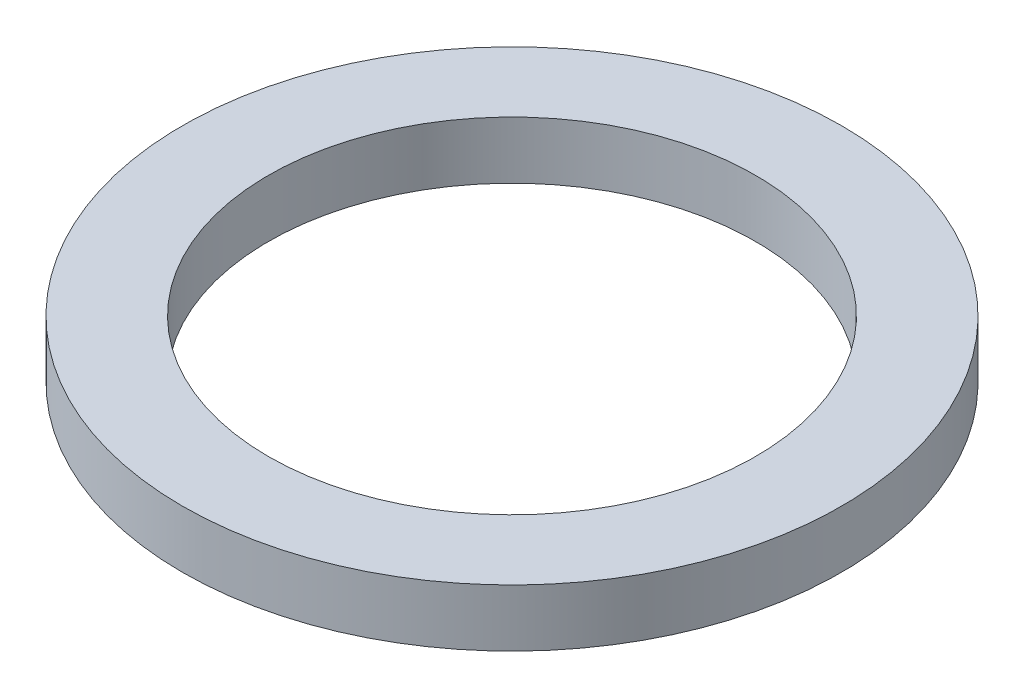
ISO-10303-21;
HEADER;
FILE_DESCRIPTION(('STEP AP214'),'2;1');
FILE_NAME('part.step','',(''),(''),'','','');
FILE_SCHEMA(('AUTOMOTIVE_DESIGN { 1 0 10303 214 1 1 1 1 }'));
ENDSEC;
DATA;
#1=APPLICATION_CONTEXT('core data for automotive mechanical design processes');
#2=APPLICATION_PROTOCOL_DEFINITION('international standard','automotive_design',2000,#1);
#3=PRODUCT_CONTEXT('',#1,'mechanical');
#4=PRODUCT('Part','Part','',(#3));
#5=PRODUCT_RELATED_PRODUCT_CATEGORY('part','',(#4));
#6=PRODUCT_DEFINITION_FORMATION('','',#4);
#7=PRODUCT_DEFINITION_CONTEXT('part definition',#1,'design');
#8=PRODUCT_DEFINITION('design','',#6,#7);
#9=PRODUCT_DEFINITION_SHAPE('','',#8);
#10=(LENGTH_UNIT() NAMED_UNIT(*) SI_UNIT(.MILLI.,.METRE.));
#11=(NAMED_UNIT(*) PLANE_ANGLE_UNIT() SI_UNIT($,.RADIAN.));
#12=(NAMED_UNIT(*) SI_UNIT($,.STERADIAN.) SOLID_ANGLE_UNIT());
#13=UNCERTAINTY_MEASURE_WITH_UNIT(LENGTH_MEASURE(1.E-05),#10,'distance_accuracy_value','');
#14=(GEOMETRIC_REPRESENTATION_CONTEXT(3) GLOBAL_UNCERTAINTY_ASSIGNED_CONTEXT((#13)) GLOBAL_UNIT_ASSIGNED_CONTEXT((#10,
#11,#12)) REPRESENTATION_CONTEXT('',''));
#15=CARTESIAN_POINT('',(0.,0.,0.));
#16=DIRECTION('',(0.,0.,1.));
#17=DIRECTION('',(1.,0.,0.));
#18=AXIS2_PLACEMENT_3D('',#15,#16,#17);
#19=CARTESIAN_POINT('',(0.,10.,0.));
#20=DIRECTION('',(0.,-1.,0.));
#21=DIRECTION('',(0.,0.,-1.));
#22=AXIS2_PLACEMENT_3D('',#19,#20,#21);
#23=CYLINDRICAL_SURFACE('',#22,57.5);
#24=CARTESIAN_POINT('',(0.,10.,0.));
#25=DIRECTION('',(0.,1.,0.));
#26=DIRECTION('',(0.,0.,1.));
#27=AXIS2_PLACEMENT_3D('',#24,#25,#26);
#28=CIRCLE('',#27,57.5);
#29=CARTESIAN_POINT('',(0.,10.,57.5));
#30=VERTEX_POINT('',#29);
#31=EDGE_CURVE('E10',#30,#30,#28,.T.);
#32=ORIENTED_EDGE('',*,*,#31,.F.);
#33=EDGE_LOOP('',(#32));
#34=FACE_BOUND('',#33,.T.);
#35=CARTESIAN_POINT('',(0.,0.,0.));
#36=DIRECTION('',(0.,1.,0.));
#37=DIRECTION('',(0.,0.,1.));
#38=AXIS2_PLACEMENT_3D('',#35,#36,#37);
#39=CIRCLE('',#38,57.5);
#40=CARTESIAN_POINT('',(0.,0.,57.5));
#41=VERTEX_POINT('',#40);
#42=EDGE_CURVE('E37',#41,#41,#39,.T.);
#43=ORIENTED_EDGE('',*,*,#42,.T.);
#44=EDGE_LOOP('',(#43));
#45=FACE_BOUND('',#44,.T.);
#46=ADVANCED_FACE('F40',(#34,#45),#23,.T.);
#47=CARTESIAN_POINT('',(0.,10.,0.));
#48=DIRECTION('',(0.,1.,0.));
#49=DIRECTION('',(0.,0.,1.));
#50=AXIS2_PLACEMENT_3D('',#47,#48,#49);
#51=PLANE('',#50);
#52=CARTESIAN_POINT('',(0.,10.,0.));
#53=DIRECTION('',(0.,1.,0.));
#54=DIRECTION('',(0.,0.,1.));
#55=AXIS2_PLACEMENT_3D('',#52,#53,#54);
#56=CIRCLE('',#55,42.5);
#57=CARTESIAN_POINT('',(0.,10.,42.5));
#58=VERTEX_POINT('',#57);
#59=EDGE_CURVE('E50',#58,#58,#56,.T.);
#60=ORIENTED_EDGE('',*,*,#59,.F.);
#61=EDGE_LOOP('',(#60));
#62=FACE_BOUND('',#61,.T.);
#63=ORIENTED_EDGE('',*,*,#31,.T.);
#64=EDGE_LOOP('',(#63));
#65=FACE_BOUND('',#64,.T.);
#66=ADVANCED_FACE('F59',(#62,#65),#51,.T.);
#67=CARTESIAN_POINT('',(0.,0.,0.));
#68=DIRECTION('',(0.,1.,0.));
#69=DIRECTION('',(0.,0.,1.));
#70=AXIS2_PLACEMENT_3D('',#67,#68,#69);
#71=PLANE('',#70);
#72=CARTESIAN_POINT('',(0.,0.,0.));
#73=DIRECTION('',(0.,1.,0.));
#74=DIRECTION('',(0.,0.,1.));
#75=AXIS2_PLACEMENT_3D('',#72,#73,#74);
#76=CIRCLE('',#75,42.5);
#77=CARTESIAN_POINT('',(0.,0.,42.5));
#78=VERTEX_POINT('',#77);
#79=EDGE_CURVE('E47',#78,#78,#76,.T.);
#80=ORIENTED_EDGE('',*,*,#79,.T.);
#81=EDGE_LOOP('',(#80));
#82=FACE_BOUND('',#81,.T.);
#83=ORIENTED_EDGE('',*,*,#42,.F.);
#84=EDGE_LOOP('',(#83));
#85=FACE_BOUND('',#84,.T.);
#86=ADVANCED_FACE('F58',(#82,#85),#71,.F.);
#87=CARTESIAN_POINT('',(0.,10.,0.));
#88=DIRECTION('',(0.,-1.,0.));
#89=DIRECTION('',(0.,0.,-1.));
#90=AXIS2_PLACEMENT_3D('',#87,#88,#89);
#91=CYLINDRICAL_SURFACE('',#90,42.5);
#92=ORIENTED_EDGE('',*,*,#59,.T.);
#93=EDGE_LOOP('',(#92));
#94=FACE_BOUND('',#93,.T.);
#95=ORIENTED_EDGE('',*,*,#79,.F.);
#96=EDGE_LOOP('',(#95));
#97=FACE_BOUND('',#96,.T.);
#98=ADVANCED_FACE('F54',(#94,#97),#91,.F.);
#99=CLOSED_SHELL('',(#46,#66,#86,#98));
#100=MANIFOLD_SOLID_BREP('B2',#99);
#101=ADVANCED_BREP_SHAPE_REPRESENTATION('',(#18,#100),#14);
#102=SHAPE_DEFINITION_REPRESENTATION(#9,#101);
ENDSEC;
END-ISO-10303-21;
